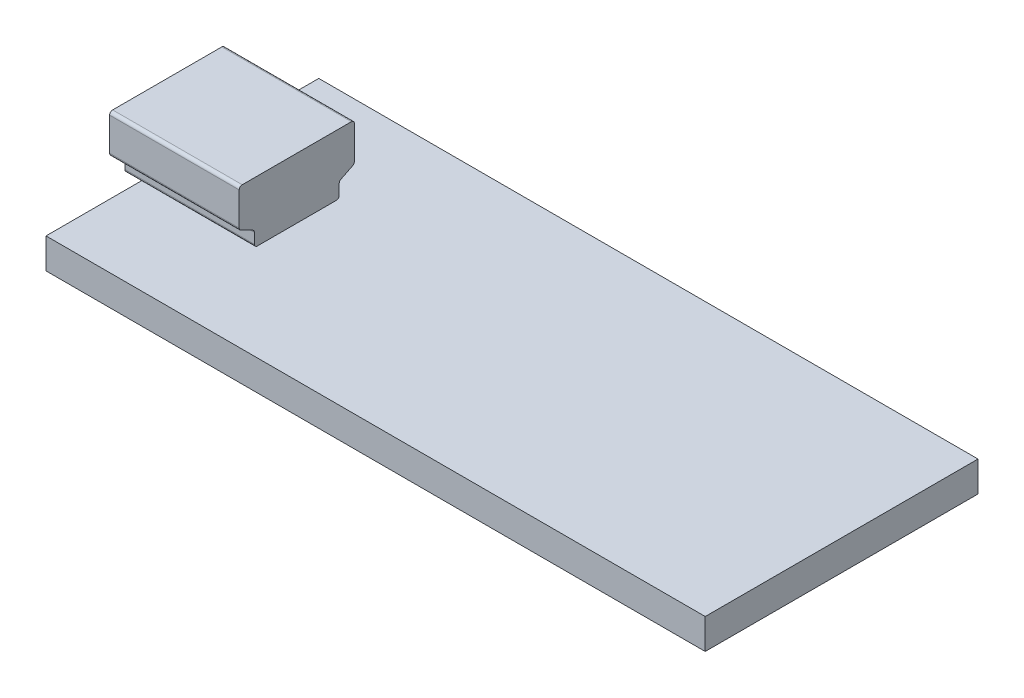
ISO-10303-21;
HEADER;
FILE_DESCRIPTION(('STEP AP214'),'2;1');
FILE_NAME('part.step','',(''),(''),'','','');
FILE_SCHEMA(('AUTOMOTIVE_DESIGN { 1 0 10303 214 1 1 1 1 }'));
ENDSEC;
DATA;
#1=APPLICATION_CONTEXT('core data for automotive mechanical design processes');
#2=APPLICATION_PROTOCOL_DEFINITION('international standard','automotive_design',2000,#1);
#3=PRODUCT_CONTEXT('',#1,'mechanical');
#4=PRODUCT('Part','Part','',(#3));
#5=PRODUCT_RELATED_PRODUCT_CATEGORY('part','',(#4));
#6=PRODUCT_DEFINITION_FORMATION('','',#4);
#7=PRODUCT_DEFINITION_CONTEXT('part definition',#1,'design');
#8=PRODUCT_DEFINITION('design','',#6,#7);
#9=PRODUCT_DEFINITION_SHAPE('','',#8);
#10=(LENGTH_UNIT() NAMED_UNIT(*) SI_UNIT(.MILLI.,.METRE.));
#11=(NAMED_UNIT(*) PLANE_ANGLE_UNIT() SI_UNIT($,.RADIAN.));
#12=(NAMED_UNIT(*) SI_UNIT($,.STERADIAN.) SOLID_ANGLE_UNIT());
#13=UNCERTAINTY_MEASURE_WITH_UNIT(LENGTH_MEASURE(1.E-05),#10,'distance_accuracy_value','');
#14=(GEOMETRIC_REPRESENTATION_CONTEXT(3) GLOBAL_UNCERTAINTY_ASSIGNED_CONTEXT((#13)) GLOBAL_UNIT_ASSIGNED_CONTEXT((#10,
#11,#12)) REPRESENTATION_CONTEXT('',''));
#15=CARTESIAN_POINT('',(0.,0.,0.));
#16=DIRECTION('',(0.,0.,1.));
#17=DIRECTION('',(1.,0.,0.));
#18=AXIS2_PLACEMENT_3D('',#15,#16,#17);
#19=CARTESIAN_POINT('',(-14.2001302464629,6.,-3.8));
#20=DIRECTION('',(-1.,0.,0.));
#21=DIRECTION('',(0.,0.,1.));
#22=AXIS2_PLACEMENT_3D('',#19,#20,#21);
#23=PLANE('',#22);
#24=CARTESIAN_POINT('',(-14.2001302464629,2.2,-2.6));
#25=DIRECTION('',(-1.,0.,0.));
#26=DIRECTION('',(0.,0.,1.));
#27=AXIS2_PLACEMENT_3D('',#24,#25,#26);
#28=CIRCLE('',#27,0.2);
#29=CARTESIAN_POINT('',(-14.2001302464629,2.2,-2.8));
#30=VERTEX_POINT('',#29);
#31=CARTESIAN_POINT('',(-14.2001302464629,2.,-2.6));
#32=VERTEX_POINT('',#31);
#33=EDGE_CURVE('E356',#30,#32,#28,.T.);
#34=ORIENTED_EDGE('',*,*,#33,.F.);
#35=DIRECTION('',(0.,-1.,0.));
#36=VECTOR('',#35,1.);
#37=CARTESIAN_POINT('',(-14.2001302464629,6.,-2.8));
#38=LINE('',#37,#36);
#39=CARTESIAN_POINT('',(-14.2001302464629,2.87639320225002,-2.8));
#40=VERTEX_POINT('',#39);
#41=EDGE_CURVE('E358',#40,#30,#38,.T.);
#42=ORIENTED_EDGE('',*,*,#41,.F.);
#43=CARTESIAN_POINT('',(-14.2001302464629,2.87639320225002,-3.));
#44=DIRECTION('',(-1.,0.,0.));
#45=DIRECTION('',(0.,0.,1.));
#46=AXIS2_PLACEMENT_3D('',#43,#44,#45);
#47=CIRCLE('',#46,0.2);
#48=CARTESIAN_POINT('',(-14.2001302464629,3.05527864045,-2.91055728090001));
#49=VERTEX_POINT('',#48);
#50=EDGE_CURVE('E347',#49,#40,#47,.F.);
#51=ORIENTED_EDGE('',*,*,#50,.F.);
#52=DIRECTION('',(0.,-0.447213595499958,0.894427190999916));
#53=VECTOR('',#52,1.);
#54=CARTESIAN_POINT('',(-14.2001302464629,4.,-4.8));
#55=LINE('',#54,#53);
#56=CARTESIAN_POINT('',(-14.2001302464629,3.44472135955,-3.68944271909999));
#57=VERTEX_POINT('',#56);
#58=EDGE_CURVE('E350',#57,#49,#55,.T.);
#59=ORIENTED_EDGE('',*,*,#58,.F.);
#60=CARTESIAN_POINT('',(-14.2001302464629,3.62360679774998,-3.6));
#61=DIRECTION('',(-1.,0.,0.));
#62=DIRECTION('',(0.,0.,1.));
#63=AXIS2_PLACEMENT_3D('',#60,#61,#62);
#64=CIRCLE('',#63,0.2);
#65=CARTESIAN_POINT('',(-14.2001302464629,3.62360679774998,-3.8));
#66=VERTEX_POINT('',#65);
#67=EDGE_CURVE('E353',#66,#57,#64,.T.);
#68=ORIENTED_EDGE('',*,*,#67,.F.);
#69=DIRECTION('',(0.,-1.,0.));
#70=VECTOR('',#69,1.);
#71=CARTESIAN_POINT('',(-14.2001302464629,6.,-3.8));
#72=LINE('',#71,#70);
#73=CARTESIAN_POINT('',(-14.2001302464629,5.8,-3.8));
#74=VERTEX_POINT('',#73);
#75=EDGE_CURVE('E443',#74,#66,#72,.T.);
#76=ORIENTED_EDGE('',*,*,#75,.F.);
#77=CARTESIAN_POINT('',(-14.2001302464629,5.8,-3.6));
#78=DIRECTION('',(-1.,0.,0.));
#79=DIRECTION('',(0.,0.,1.));
#80=AXIS2_PLACEMENT_3D('',#77,#78,#79);
#81=CIRCLE('',#80,0.2);
#82=CARTESIAN_POINT('',(-14.2001302464629,6.,-3.6));
#83=VERTEX_POINT('',#82);
#84=EDGE_CURVE('E361',#83,#74,#81,.T.);
#85=ORIENTED_EDGE('',*,*,#84,.F.);
#86=DIRECTION('',(0.,0.,-1.));
#87=VECTOR('',#86,1.);
#88=CARTESIAN_POINT('',(-14.2001302464629,6.,-3.8));
#89=LINE('',#88,#87);
#90=CARTESIAN_POINT('',(-14.2001302464629,6.,3.6));
#91=VERTEX_POINT('',#90);
#92=EDGE_CURVE('E441',#91,#83,#89,.T.);
#93=ORIENTED_EDGE('',*,*,#92,.F.);
#94=CARTESIAN_POINT('',(-14.2001302464629,5.8,3.6));
#95=DIRECTION('',(-1.,0.,0.));
#96=DIRECTION('',(0.,0.,1.));
#97=AXIS2_PLACEMENT_3D('',#94,#95,#96);
#98=CIRCLE('',#97,0.2);
#99=CARTESIAN_POINT('',(-14.2001302464629,5.8,3.8));
#100=VERTEX_POINT('',#99);
#101=EDGE_CURVE('E328',#100,#91,#98,.T.);
#102=ORIENTED_EDGE('',*,*,#101,.F.);
#103=DIRECTION('',(0.,-1.,0.));
#104=VECTOR('',#103,1.);
#105=CARTESIAN_POINT('',(-14.2001302464629,6.,3.8));
#106=LINE('',#105,#104);
#107=CARTESIAN_POINT('',(-14.2001302464629,3.62360679774998,3.8));
#108=VERTEX_POINT('',#107);
#109=EDGE_CURVE('E448',#100,#108,#106,.T.);
#110=ORIENTED_EDGE('',*,*,#109,.T.);
#111=CARTESIAN_POINT('',(-14.2001302464629,3.62360679774998,3.6));
#112=DIRECTION('',(-1.,0.,0.));
#113=DIRECTION('',(0.,0.,1.));
#114=AXIS2_PLACEMENT_3D('',#111,#112,#113);
#115=CIRCLE('',#114,0.2);
#116=CARTESIAN_POINT('',(-14.2001302464629,3.44472135955,3.68944271909999));
#117=VERTEX_POINT('',#116);
#118=EDGE_CURVE('E338',#117,#108,#115,.T.);
#119=ORIENTED_EDGE('',*,*,#118,.F.);
#120=DIRECTION('',(0.,0.447213595499958,0.894427190999916));
#121=VECTOR('',#120,1.);
#122=CARTESIAN_POINT('',(-14.2001302464629,0.96,-1.28));
#123=LINE('',#122,#121);
#124=CARTESIAN_POINT('',(-14.2001302464629,3.05527864045001,2.91055728090001));
#125=VERTEX_POINT('',#124);
#126=EDGE_CURVE('E341',#125,#117,#123,.T.);
#127=ORIENTED_EDGE('',*,*,#126,.F.);
#128=CARTESIAN_POINT('',(-14.2001302464629,2.87639320225002,3.));
#129=DIRECTION('',(-1.,0.,0.));
#130=DIRECTION('',(0.,0.,1.));
#131=AXIS2_PLACEMENT_3D('',#128,#129,#130);
#132=CIRCLE('',#131,0.200000000000001);
#133=CARTESIAN_POINT('',(-14.2001302464629,2.87639320225002,2.8));
#134=VERTEX_POINT('',#133);
#135=EDGE_CURVE('E344',#134,#125,#132,.F.);
#136=ORIENTED_EDGE('',*,*,#135,.F.);
#137=DIRECTION('',(0.,1.,0.));
#138=VECTOR('',#137,1.);
#139=CARTESIAN_POINT('',(-14.2001302464629,6.,2.8));
#140=LINE('',#139,#138);
#141=CARTESIAN_POINT('',(-14.2001302464629,2.2,2.8));
#142=VERTEX_POINT('',#141);
#143=EDGE_CURVE('E332',#142,#134,#140,.T.);
#144=ORIENTED_EDGE('',*,*,#143,.F.);
#145=CARTESIAN_POINT('',(-14.2001302464629,2.2,2.6));
#146=DIRECTION('',(-1.,0.,0.));
#147=DIRECTION('',(0.,0.,1.));
#148=AXIS2_PLACEMENT_3D('',#145,#146,#147);
#149=CIRCLE('',#148,0.2);
#150=CARTESIAN_POINT('',(-14.2001302464629,2.,2.6));
#151=VERTEX_POINT('',#150);
#152=EDGE_CURVE('E335',#151,#142,#149,.T.);
#153=ORIENTED_EDGE('',*,*,#152,.F.);
#154=DIRECTION('',(0.,0.,-1.));
#155=VECTOR('',#154,1.);
#156=CARTESIAN_POINT('',(-14.2001302464629,2.,-3.8));
#157=LINE('',#156,#155);
#158=EDGE_CURVE('E440',#151,#32,#157,.T.);
#159=ORIENTED_EDGE('',*,*,#158,.T.);
#160=EDGE_LOOP('',(#34,#42,#51,#59,#68,#76,#85,#93,#102,#110,#119,#127,#136,#144,#153,#159));
#161=FACE_BOUND('',#160,.T.);
#162=ADVANCED_FACE('F35',(#161),#23,.F.);
#163=CARTESIAN_POINT('',(-14.2001302464629,6.,3.8));
#164=DIRECTION('',(0.,0.,-1.));
#165=DIRECTION('',(-1.,0.,0.));
#166=AXIS2_PLACEMENT_3D('',#163,#164,#165);
#167=PLANE('',#166);
#168=DIRECTION('',(1.,0.,0.));
#169=VECTOR('',#168,1.);
#170=CARTESIAN_POINT('',(-22.75,3.62360679774998,3.8));
#171=LINE('',#170,#169);
#172=CARTESIAN_POINT('',(-22.75,3.62360679774998,3.8));
#173=VERTEX_POINT('',#172);
#174=EDGE_CURVE('E408',#173,#108,#171,.T.);
#175=ORIENTED_EDGE('',*,*,#174,.T.);
#176=ORIENTED_EDGE('',*,*,#109,.F.);
#177=DIRECTION('',(1.,0.,0.));
#178=VECTOR('',#177,1.);
#179=CARTESIAN_POINT('',(-22.75,5.8,3.8));
#180=LINE('',#179,#178);
#181=CARTESIAN_POINT('',(-22.75,5.8,3.8));
#182=VERTEX_POINT('',#181);
#183=EDGE_CURVE('E404',#182,#100,#180,.T.);
#184=ORIENTED_EDGE('',*,*,#183,.F.);
#185=DIRECTION('',(0.,1.,0.));
#186=VECTOR('',#185,1.);
#187=CARTESIAN_POINT('',(-22.75,0.,3.8));
#188=LINE('',#187,#186);
#189=EDGE_CURVE('E402',#173,#182,#188,.T.);
#190=ORIENTED_EDGE('',*,*,#189,.F.);
#191=EDGE_LOOP('',(#175,#176,#184,#190));
#192=FACE_BOUND('',#191,.T.);
#193=ADVANCED_FACE('F538',(#192),#167,.F.);
#194=CARTESIAN_POINT('',(0.,6.,0.));
#195=DIRECTION('',(0.,-1.,0.));
#196=DIRECTION('',(0.,0.,-1.));
#197=AXIS2_PLACEMENT_3D('',#194,#195,#196);
#198=PLANE('',#197);
#199=DIRECTION('',(1.,0.,0.));
#200=VECTOR('',#199,1.);
#201=CARTESIAN_POINT('',(-22.75,6.,3.6));
#202=LINE('',#201,#200);
#203=CARTESIAN_POINT('',(-22.75,6.,3.6));
#204=VERTEX_POINT('',#203);
#205=EDGE_CURVE('E58',#204,#91,#202,.T.);
#206=ORIENTED_EDGE('',*,*,#205,.T.);
#207=ORIENTED_EDGE('',*,*,#92,.T.);
#208=DIRECTION('',(1.,0.,0.));
#209=VECTOR('',#208,1.);
#210=CARTESIAN_POINT('',(-22.75,6.,-3.6));
#211=LINE('',#210,#209);
#212=CARTESIAN_POINT('',(-22.75,6.,-3.6));
#213=VERTEX_POINT('',#212);
#214=EDGE_CURVE('E436',#213,#83,#211,.T.);
#215=ORIENTED_EDGE('',*,*,#214,.F.);
#216=DIRECTION('',(0.,0.,-1.));
#217=VECTOR('',#216,1.);
#218=CARTESIAN_POINT('',(-22.75,6.,0.));
#219=LINE('',#218,#217);
#220=EDGE_CURVE('E368',#204,#213,#219,.T.);
#221=ORIENTED_EDGE('',*,*,#220,.F.);
#222=EDGE_LOOP('',(#206,#207,#215,#221));
#223=FACE_BOUND('',#222,.T.);
#224=ADVANCED_FACE('F544',(#223),#198,.F.);
#225=CARTESIAN_POINT('',(-14.2001302464629,6.,-3.8));
#226=DIRECTION('',(0.,0.,1.));
#227=DIRECTION('',(1.,0.,0.));
#228=AXIS2_PLACEMENT_3D('',#225,#226,#227);
#229=PLANE('',#228);
#230=ORIENTED_EDGE('',*,*,#75,.T.);
#231=DIRECTION('',(1.,0.,0.));
#232=VECTOR('',#231,1.);
#233=CARTESIAN_POINT('',(-22.75,3.62360679774998,-3.8));
#234=LINE('',#233,#232);
#235=CARTESIAN_POINT('',(-22.75,3.62360679774998,-3.8));
#236=VERTEX_POINT('',#235);
#237=EDGE_CURVE('E432',#236,#66,#234,.T.);
#238=ORIENTED_EDGE('',*,*,#237,.F.);
#239=DIRECTION('',(0.,-1.,0.));
#240=VECTOR('',#239,1.);
#241=CARTESIAN_POINT('',(-22.75,0.,-3.8));
#242=LINE('',#241,#240);
#243=CARTESIAN_POINT('',(-22.75,5.8,-3.8));
#244=VERTEX_POINT('',#243);
#245=EDGE_CURVE('E373',#244,#236,#242,.T.);
#246=ORIENTED_EDGE('',*,*,#245,.F.);
#247=DIRECTION('',(1.,0.,0.));
#248=VECTOR('',#247,1.);
#249=CARTESIAN_POINT('',(-22.75,5.8,-3.8));
#250=LINE('',#249,#248);
#251=EDGE_CURVE('E434',#244,#74,#250,.T.);
#252=ORIENTED_EDGE('',*,*,#251,.T.);
#253=EDGE_LOOP('',(#230,#238,#246,#252));
#254=FACE_BOUND('',#253,.T.);
#255=ADVANCED_FACE('F554',(#254),#229,.F.);
#256=CARTESIAN_POINT('',(-21.75,2.,-9.));
#257=DIRECTION('',(1.,0.,0.));
#258=DIRECTION('',(0.,0.,-1.));
#259=AXIS2_PLACEMENT_3D('',#256,#257,#258);
#260=PLANE('',#259);
#261=DIRECTION('',(0.,0.,1.));
#262=VECTOR('',#261,1.);
#263=CARTESIAN_POINT('',(-21.75,2.,0.));
#264=LINE('',#263,#262);
#265=CARTESIAN_POINT('',(-21.75,2.,-2.6));
#266=VERTEX_POINT('',#265);
#267=CARTESIAN_POINT('',(-21.75,2.,2.6));
#268=VERTEX_POINT('',#267);
#269=EDGE_CURVE('E364',#266,#268,#264,.T.);
#270=ORIENTED_EDGE('',*,*,#269,.F.);
#271=DIRECTION('',(0.,0.,1.));
#272=VECTOR('',#271,1.);
#273=CARTESIAN_POINT('',(-21.75,2.,-9.));
#274=LINE('',#273,#272);
#275=CARTESIAN_POINT('',(-21.75,2.,-9.));
#276=VERTEX_POINT('',#275);
#277=EDGE_CURVE('E459',#276,#266,#274,.T.);
#278=ORIENTED_EDGE('',*,*,#277,.F.);
#279=DIRECTION('',(0.,-1.,0.));
#280=VECTOR('',#279,1.);
#281=CARTESIAN_POINT('',(-21.75,2.,-9.));
#282=LINE('',#281,#280);
#283=CARTESIAN_POINT('',(-21.75,0.,-9.));
#284=VERTEX_POINT('',#283);
#285=EDGE_CURVE('E43',#276,#284,#282,.T.);
#286=ORIENTED_EDGE('',*,*,#285,.T.);
#287=DIRECTION('',(0.,0.,1.));
#288=VECTOR('',#287,1.);
#289=CARTESIAN_POINT('',(-21.75,0.,-9.));
#290=LINE('',#289,#288);
#291=CARTESIAN_POINT('',(-21.75,0.,9.));
#292=VERTEX_POINT('',#291);
#293=EDGE_CURVE('E468',#284,#292,#290,.T.);
#294=ORIENTED_EDGE('',*,*,#293,.T.);
#295=DIRECTION('',(0.,-1.,0.));
#296=VECTOR('',#295,1.);
#297=CARTESIAN_POINT('',(-21.75,2.,9.));
#298=LINE('',#297,#296);
#299=CARTESIAN_POINT('',(-21.75,2.,9.));
#300=VERTEX_POINT('',#299);
#301=EDGE_CURVE('E473',#300,#292,#298,.T.);
#302=ORIENTED_EDGE('',*,*,#301,.F.);
#303=EDGE_CURVE('E458',#268,#300,#274,.T.);
#304=ORIENTED_EDGE('',*,*,#303,.F.);
#305=EDGE_LOOP('',(#270,#278,#286,#294,#302,#304));
#306=FACE_BOUND('',#305,.T.);
#307=ADVANCED_FACE('F481',(#306),#260,.F.);
#308=CARTESIAN_POINT('',(21.75,2.,-9.));
#309=DIRECTION('',(-1.,0.,0.));
#310=DIRECTION('',(0.,0.,1.));
#311=AXIS2_PLACEMENT_3D('',#308,#309,#310);
#312=PLANE('',#311);
#313=DIRECTION('',(0.,0.,-1.));
#314=VECTOR('',#313,1.);
#315=CARTESIAN_POINT('',(21.75,0.,-9.));
#316=LINE('',#315,#314);
#317=CARTESIAN_POINT('',(21.75,0.,9.));
#318=VERTEX_POINT('',#317);
#319=CARTESIAN_POINT('',(21.75,0.,-9.));
#320=VERTEX_POINT('',#319);
#321=EDGE_CURVE('E451',#318,#320,#316,.T.);
#322=ORIENTED_EDGE('',*,*,#321,.T.);
#323=DIRECTION('',(0.,-1.,0.));
#324=VECTOR('',#323,1.);
#325=CARTESIAN_POINT('',(21.75,2.,-9.));
#326=LINE('',#325,#324);
#327=CARTESIAN_POINT('',(21.75,2.,-9.));
#328=VERTEX_POINT('',#327);
#329=EDGE_CURVE('E11',#328,#320,#326,.T.);
#330=ORIENTED_EDGE('',*,*,#329,.F.);
#331=DIRECTION('',(0.,0.,-1.));
#332=VECTOR('',#331,1.);
#333=CARTESIAN_POINT('',(21.75,2.,-9.));
#334=LINE('',#333,#332);
#335=CARTESIAN_POINT('',(21.75,2.,9.));
#336=VERTEX_POINT('',#335);
#337=EDGE_CURVE('E452',#336,#328,#334,.T.);
#338=ORIENTED_EDGE('',*,*,#337,.F.);
#339=DIRECTION('',(0.,-1.,0.));
#340=VECTOR('',#339,1.);
#341=CARTESIAN_POINT('',(21.75,2.,9.));
#342=LINE('',#341,#340);
#343=EDGE_CURVE('E463',#336,#318,#342,.T.);
#344=ORIENTED_EDGE('',*,*,#343,.T.);
#345=EDGE_LOOP('',(#322,#330,#338,#344));
#346=FACE_BOUND('',#345,.T.);
#347=ADVANCED_FACE('F37',(#346),#312,.F.);
#348=CARTESIAN_POINT('',(-21.75,2.,-9.));
#349=DIRECTION('',(0.,0.,1.));
#350=DIRECTION('',(1.,0.,0.));
#351=AXIS2_PLACEMENT_3D('',#348,#349,#350);
#352=PLANE('',#351);
#353=DIRECTION('',(-1.,0.,0.));
#354=VECTOR('',#353,1.);
#355=CARTESIAN_POINT('',(-21.75,0.,-9.));
#356=LINE('',#355,#354);
#357=EDGE_CURVE('E466',#320,#284,#356,.T.);
#358=ORIENTED_EDGE('',*,*,#357,.T.);
#359=ORIENTED_EDGE('',*,*,#285,.F.);
#360=DIRECTION('',(-1.,0.,0.));
#361=VECTOR('',#360,1.);
#362=CARTESIAN_POINT('',(-21.75,2.,-9.));
#363=LINE('',#362,#361);
#364=EDGE_CURVE('E455',#328,#276,#363,.T.);
#365=ORIENTED_EDGE('',*,*,#364,.F.);
#366=ORIENTED_EDGE('',*,*,#329,.T.);
#367=EDGE_LOOP('',(#358,#359,#365,#366));
#368=FACE_BOUND('',#367,.T.);
#369=ADVANCED_FACE('F595',(#368),#352,.F.);
#370=CARTESIAN_POINT('',(-21.75,2.,9.));
#371=DIRECTION('',(0.,0.,-1.));
#372=DIRECTION('',(-1.,0.,0.));
#373=AXIS2_PLACEMENT_3D('',#370,#371,#372);
#374=PLANE('',#373);
#375=DIRECTION('',(1.,0.,0.));
#376=VECTOR('',#375,1.);
#377=CARTESIAN_POINT('',(-21.75,0.,9.));
#378=LINE('',#377,#376);
#379=EDGE_CURVE('E456',#292,#318,#378,.T.);
#380=ORIENTED_EDGE('',*,*,#379,.T.);
#381=ORIENTED_EDGE('',*,*,#343,.F.);
#382=DIRECTION('',(1.,0.,0.));
#383=VECTOR('',#382,1.);
#384=CARTESIAN_POINT('',(-21.75,2.,9.));
#385=LINE('',#384,#383);
#386=EDGE_CURVE('E461',#300,#336,#385,.T.);
#387=ORIENTED_EDGE('',*,*,#386,.F.);
#388=ORIENTED_EDGE('',*,*,#301,.T.);
#389=EDGE_LOOP('',(#380,#381,#387,#388));
#390=FACE_BOUND('',#389,.T.);
#391=ADVANCED_FACE('F490',(#390),#374,.F.);
#392=CARTESIAN_POINT('',(0.,2.,0.));
#393=DIRECTION('',(0.,1.,0.));
#394=DIRECTION('',(0.,0.,1.));
#395=AXIS2_PLACEMENT_3D('',#392,#393,#394);
#396=PLANE('',#395);
#397=DIRECTION('',(-1.,0.,0.));
#398=VECTOR('',#397,1.);
#399=CARTESIAN_POINT('',(-7.75,2.,-2.6));
#400=LINE('',#399,#398);
#401=EDGE_CURVE('E325',#32,#266,#400,.T.);
#402=ORIENTED_EDGE('',*,*,#401,.F.);
#403=ORIENTED_EDGE('',*,*,#158,.F.);
#404=DIRECTION('',(-1.,0.,0.));
#405=VECTOR('',#404,1.);
#406=CARTESIAN_POINT('',(-7.75,2.,2.6));
#407=LINE('',#406,#405);
#408=EDGE_CURVE('E309',#151,#268,#407,.T.);
#409=ORIENTED_EDGE('',*,*,#408,.T.);
#410=ORIENTED_EDGE('',*,*,#303,.T.);
#411=ORIENTED_EDGE('',*,*,#386,.T.);
#412=ORIENTED_EDGE('',*,*,#337,.T.);
#413=ORIENTED_EDGE('',*,*,#364,.T.);
#414=ORIENTED_EDGE('',*,*,#277,.T.);
#415=EDGE_LOOP('',(#402,#403,#409,#410,#411,#412,#413,#414));
#416=FACE_BOUND('',#415,.T.);
#417=ADVANCED_FACE('F497',(#416),#396,.T.);
#418=CARTESIAN_POINT('',(0.,0.,0.));
#419=DIRECTION('',(0.,1.,0.));
#420=DIRECTION('',(0.,0.,1.));
#421=AXIS2_PLACEMENT_3D('',#418,#419,#420);
#422=PLANE('',#421);
#423=ORIENTED_EDGE('',*,*,#321,.F.);
#424=ORIENTED_EDGE('',*,*,#379,.F.);
#425=ORIENTED_EDGE('',*,*,#293,.F.);
#426=ORIENTED_EDGE('',*,*,#357,.F.);
#427=EDGE_LOOP('',(#423,#424,#425,#426));
#428=FACE_BOUND('',#427,.T.);
#429=ADVANCED_FACE('F487',(#428),#422,.F.);
#430=CARTESIAN_POINT('',(-22.75,5.8,3.6));
#431=DIRECTION('',(1.,0.,0.));
#432=DIRECTION('',(0.,0.,-1.));
#433=AXIS2_PLACEMENT_3D('',#430,#431,#432);
#434=CYLINDRICAL_SURFACE('',#433,0.2);
#435=ORIENTED_EDGE('',*,*,#183,.T.);
#436=ORIENTED_EDGE('',*,*,#101,.T.);
#437=ORIENTED_EDGE('',*,*,#205,.F.);
#438=CARTESIAN_POINT('',(-22.75,5.8,3.6));
#439=DIRECTION('',(-1.,0.,0.));
#440=DIRECTION('',(0.,0.,1.));
#441=AXIS2_PLACEMENT_3D('',#438,#439,#440);
#442=CIRCLE('',#441,0.2);
#443=EDGE_CURVE('E365',#204,#182,#442,.F.);
#444=ORIENTED_EDGE('',*,*,#443,.T.);
#445=EDGE_LOOP('',(#435,#436,#437,#444));
#446=FACE_BOUND('',#445,.T.);
#447=ADVANCED_FACE('F541',(#446),#434,.T.);
#448=CARTESIAN_POINT('',(-22.75,5.8,-3.6));
#449=DIRECTION('',(1.,0.,0.));
#450=DIRECTION('',(0.,0.,-1.));
#451=AXIS2_PLACEMENT_3D('',#448,#449,#450);
#452=CYLINDRICAL_SURFACE('',#451,0.2);
#453=ORIENTED_EDGE('',*,*,#214,.T.);
#454=ORIENTED_EDGE('',*,*,#84,.T.);
#455=ORIENTED_EDGE('',*,*,#251,.F.);
#456=CARTESIAN_POINT('',(-22.75,5.8,-3.6));
#457=DIRECTION('',(-1.,0.,0.));
#458=DIRECTION('',(0.,0.,1.));
#459=AXIS2_PLACEMENT_3D('',#456,#457,#458);
#460=CIRCLE('',#459,0.2);
#461=EDGE_CURVE('E370',#244,#213,#460,.F.);
#462=ORIENTED_EDGE('',*,*,#461,.T.);
#463=EDGE_LOOP('',(#453,#454,#455,#462));
#464=FACE_BOUND('',#463,.T.);
#465=ADVANCED_FACE('F550',(#464),#452,.T.);
#466=CARTESIAN_POINT('',(-22.75,3.62360679774998,-3.6));
#467=DIRECTION('',(1.,0.,0.));
#468=DIRECTION('',(0.,0.,-1.));
#469=AXIS2_PLACEMENT_3D('',#466,#467,#468);
#470=CYLINDRICAL_SURFACE('',#469,0.2);
#471=ORIENTED_EDGE('',*,*,#237,.T.);
#472=ORIENTED_EDGE('',*,*,#67,.T.);
#473=DIRECTION('',(1.,0.,0.));
#474=VECTOR('',#473,1.);
#475=CARTESIAN_POINT('',(-22.75,3.44472135955,-3.68944271909999));
#476=LINE('',#475,#474);
#477=CARTESIAN_POINT('',(-22.75,3.44472135955,-3.68944271909999));
#478=VERTEX_POINT('',#477);
#479=EDGE_CURVE('E430',#478,#57,#476,.T.);
#480=ORIENTED_EDGE('',*,*,#479,.F.);
#481=CARTESIAN_POINT('',(-22.75,3.62360679774998,-3.6));
#482=DIRECTION('',(-1.,0.,0.));
#483=DIRECTION('',(0.,0.,1.));
#484=AXIS2_PLACEMENT_3D('',#481,#482,#483);
#485=CIRCLE('',#484,0.2);
#486=EDGE_CURVE('E375',#478,#236,#485,.F.);
#487=ORIENTED_EDGE('',*,*,#486,.T.);
#488=EDGE_LOOP('',(#471,#472,#480,#487));
#489=FACE_BOUND('',#488,.T.);
#490=ADVANCED_FACE('F557',(#489),#470,.T.);
#491=CARTESIAN_POINT('',(-22.75,1.28,0.64));
#492=DIRECTION('',(0.,0.894427190999916,0.447213595499958));
#493=DIRECTION('',(0.,-0.447213595499958,0.894427190999916));
#494=AXIS2_PLACEMENT_3D('',#491,#492,#493);
#495=PLANE('',#494);
#496=ORIENTED_EDGE('',*,*,#479,.T.);
#497=ORIENTED_EDGE('',*,*,#58,.T.);
#498=DIRECTION('',(1.,0.,0.));
#499=VECTOR('',#498,1.);
#500=CARTESIAN_POINT('',(-22.75,3.05527864045001,-2.91055728090001));
#501=LINE('',#500,#499);
#502=CARTESIAN_POINT('',(-22.75,3.05527864045001,-2.91055728090001));
#503=VERTEX_POINT('',#502);
#504=EDGE_CURVE('E428',#503,#49,#501,.T.);
#505=ORIENTED_EDGE('',*,*,#504,.F.);
#506=DIRECTION('',(0.,-0.447213595499958,0.894427190999916));
#507=VECTOR('',#506,1.);
#508=CARTESIAN_POINT('',(-22.75,1.28,0.64));
#509=LINE('',#508,#507);
#510=EDGE_CURVE('E378',#478,#503,#509,.T.);
#511=ORIENTED_EDGE('',*,*,#510,.F.);
#512=EDGE_LOOP('',(#496,#497,#505,#511));
#513=FACE_BOUND('',#512,.T.);
#514=ADVANCED_FACE('F563',(#513),#495,.F.);
#515=CARTESIAN_POINT('',(-22.75,2.87639320225002,-3.));
#516=DIRECTION('',(1.,0.,0.));
#517=DIRECTION('',(0.,0.,-1.));
#518=AXIS2_PLACEMENT_3D('',#515,#516,#517);
#519=CYLINDRICAL_SURFACE('',#518,0.2);
#520=ORIENTED_EDGE('',*,*,#504,.T.);
#521=ORIENTED_EDGE('',*,*,#50,.T.);
#522=DIRECTION('',(1.,0.,0.));
#523=VECTOR('',#522,1.);
#524=CARTESIAN_POINT('',(-22.75,2.87639320225002,-2.8));
#525=LINE('',#524,#523);
#526=CARTESIAN_POINT('',(-22.75,2.87639320225002,-2.8));
#527=VERTEX_POINT('',#526);
#528=EDGE_CURVE('E426',#527,#40,#525,.T.);
#529=ORIENTED_EDGE('',*,*,#528,.F.);
#530=CARTESIAN_POINT('',(-22.75,2.87639320225002,-3.));
#531=DIRECTION('',(-1.,0.,0.));
#532=DIRECTION('',(0.,0.,1.));
#533=AXIS2_PLACEMENT_3D('',#530,#531,#532);
#534=CIRCLE('',#533,0.2);
#535=EDGE_CURVE('E380',#503,#527,#534,.F.);
#536=ORIENTED_EDGE('',*,*,#535,.F.);
#537=EDGE_LOOP('',(#520,#521,#529,#536));
#538=FACE_BOUND('',#537,.T.);
#539=ADVANCED_FACE('F567',(#538),#519,.F.);
#540=CARTESIAN_POINT('',(-22.75,0.,-2.8));
#541=DIRECTION('',(0.,0.,1.));
#542=DIRECTION('',(1.,0.,0.));
#543=AXIS2_PLACEMENT_3D('',#540,#541,#542);
#544=PLANE('',#543);
#545=ORIENTED_EDGE('',*,*,#528,.T.);
#546=ORIENTED_EDGE('',*,*,#41,.T.);
#547=DIRECTION('',(1.,0.,0.));
#548=VECTOR('',#547,1.);
#549=CARTESIAN_POINT('',(-22.75,2.2,-2.8));
#550=LINE('',#549,#548);
#551=CARTESIAN_POINT('',(-22.75,2.2,-2.8));
#552=VERTEX_POINT('',#551);
#553=EDGE_CURVE('E424',#552,#30,#550,.T.);
#554=ORIENTED_EDGE('',*,*,#553,.F.);
#555=DIRECTION('',(0.,-1.,0.));
#556=VECTOR('',#555,1.);
#557=CARTESIAN_POINT('',(-22.75,0.,-2.8));
#558=LINE('',#557,#556);
#559=EDGE_CURVE('E382',#527,#552,#558,.T.);
#560=ORIENTED_EDGE('',*,*,#559,.F.);
#561=EDGE_LOOP('',(#545,#546,#554,#560));
#562=FACE_BOUND('',#561,.T.);
#563=ADVANCED_FACE('F571',(#562),#544,.F.);
#564=CARTESIAN_POINT('',(-22.75,2.2,-2.6));
#565=DIRECTION('',(1.,0.,0.));
#566=DIRECTION('',(0.,0.,-1.));
#567=AXIS2_PLACEMENT_3D('',#564,#565,#566);
#568=CYLINDRICAL_SURFACE('',#567,0.2);
#569=ORIENTED_EDGE('',*,*,#553,.T.);
#570=ORIENTED_EDGE('',*,*,#33,.T.);
#571=ORIENTED_EDGE('',*,*,#401,.T.);
#572=DIRECTION('',(1.,0.,0.));
#573=VECTOR('',#572,1.);
#574=CARTESIAN_POINT('',(-22.75,2.,-2.6));
#575=LINE('',#574,#573);
#576=CARTESIAN_POINT('',(-22.75,2.,-2.6));
#577=VERTEX_POINT('',#576);
#578=EDGE_CURVE('E421',#577,#266,#575,.T.);
#579=ORIENTED_EDGE('',*,*,#578,.F.);
#580=CARTESIAN_POINT('',(-22.75,2.2,-2.6));
#581=DIRECTION('',(-1.,0.,0.));
#582=DIRECTION('',(0.,0.,1.));
#583=AXIS2_PLACEMENT_3D('',#580,#581,#582);
#584=CIRCLE('',#583,0.2);
#585=EDGE_CURVE('E384',#552,#577,#584,.T.);
#586=ORIENTED_EDGE('',*,*,#585,.F.);
#587=EDGE_LOOP('',(#569,#570,#571,#579,#586));
#588=FACE_BOUND('',#587,.T.);
#589=ADVANCED_FACE('F506',(#588),#568,.T.);
#590=CARTESIAN_POINT('',(-22.75,2.,0.));
#591=DIRECTION('',(0.,1.,0.));
#592=DIRECTION('',(0.,0.,1.));
#593=AXIS2_PLACEMENT_3D('',#590,#591,#592);
#594=PLANE('',#593);
#595=ORIENTED_EDGE('',*,*,#269,.T.);
#596=DIRECTION('',(1.,0.,0.));
#597=VECTOR('',#596,1.);
#598=CARTESIAN_POINT('',(-22.75,2.,2.6));
#599=LINE('',#598,#597);
#600=CARTESIAN_POINT('',(-22.75,2.,2.6));
#601=VERTEX_POINT('',#600);
#602=EDGE_CURVE('E418',#601,#268,#599,.T.);
#603=ORIENTED_EDGE('',*,*,#602,.F.);
#604=DIRECTION('',(0.,0.,1.));
#605=VECTOR('',#604,1.);
#606=CARTESIAN_POINT('',(-22.75,2.,0.));
#607=LINE('',#606,#605);
#608=EDGE_CURVE('E386',#577,#601,#607,.T.);
#609=ORIENTED_EDGE('',*,*,#608,.F.);
#610=ORIENTED_EDGE('',*,*,#578,.T.);
#611=EDGE_LOOP('',(#595,#603,#609,#610));
#612=FACE_BOUND('',#611,.T.);
#613=ADVANCED_FACE('F501',(#612),#594,.F.);
#614=CARTESIAN_POINT('',(-22.75,2.2,2.6));
#615=DIRECTION('',(1.,0.,0.));
#616=DIRECTION('',(0.,0.,-1.));
#617=AXIS2_PLACEMENT_3D('',#614,#615,#616);
#618=CYLINDRICAL_SURFACE('',#617,0.2);
#619=ORIENTED_EDGE('',*,*,#602,.T.);
#620=ORIENTED_EDGE('',*,*,#408,.F.);
#621=ORIENTED_EDGE('',*,*,#152,.T.);
#622=DIRECTION('',(1.,0.,0.));
#623=VECTOR('',#622,1.);
#624=CARTESIAN_POINT('',(-22.75,2.2,2.8));
#625=LINE('',#624,#623);
#626=CARTESIAN_POINT('',(-22.75,2.2,2.8));
#627=VERTEX_POINT('',#626);
#628=EDGE_CURVE('E416',#627,#142,#625,.T.);
#629=ORIENTED_EDGE('',*,*,#628,.F.);
#630=CARTESIAN_POINT('',(-22.75,2.2,2.6));
#631=DIRECTION('',(-1.,0.,0.));
#632=DIRECTION('',(0.,0.,1.));
#633=AXIS2_PLACEMENT_3D('',#630,#631,#632);
#634=CIRCLE('',#633,0.2);
#635=EDGE_CURVE('E388',#627,#601,#634,.F.);
#636=ORIENTED_EDGE('',*,*,#635,.T.);
#637=EDGE_LOOP('',(#619,#620,#621,#629,#636));
#638=FACE_BOUND('',#637,.T.);
#639=ADVANCED_FACE('F514',(#638),#618,.T.);
#640=CARTESIAN_POINT('',(-22.75,0.,2.8));
#641=DIRECTION('',(0.,0.,1.));
#642=DIRECTION('',(1.,0.,0.));
#643=AXIS2_PLACEMENT_3D('',#640,#641,#642);
#644=PLANE('',#643);
#645=ORIENTED_EDGE('',*,*,#628,.T.);
#646=ORIENTED_EDGE('',*,*,#143,.T.);
#647=DIRECTION('',(1.,0.,0.));
#648=VECTOR('',#647,1.);
#649=CARTESIAN_POINT('',(-22.75,2.87639320225002,2.8));
#650=LINE('',#649,#648);
#651=CARTESIAN_POINT('',(-22.75,2.87639320225002,2.8));
#652=VERTEX_POINT('',#651);
#653=EDGE_CURVE('E414',#652,#134,#650,.T.);
#654=ORIENTED_EDGE('',*,*,#653,.F.);
#655=DIRECTION('',(0.,-1.,0.));
#656=VECTOR('',#655,1.);
#657=CARTESIAN_POINT('',(-22.75,0.,2.8));
#658=LINE('',#657,#656);
#659=EDGE_CURVE('E391',#652,#627,#658,.T.);
#660=ORIENTED_EDGE('',*,*,#659,.T.);
#661=EDGE_LOOP('',(#645,#646,#654,#660));
#662=FACE_BOUND('',#661,.T.);
#663=ADVANCED_FACE('F522',(#662),#644,.T.);
#664=CARTESIAN_POINT('',(-22.75,2.87639320225002,3.));
#665=DIRECTION('',(1.,0.,0.));
#666=DIRECTION('',(0.,0.,-1.));
#667=AXIS2_PLACEMENT_3D('',#664,#665,#666);
#668=CYLINDRICAL_SURFACE('',#667,0.2);
#669=ORIENTED_EDGE('',*,*,#653,.T.);
#670=ORIENTED_EDGE('',*,*,#135,.T.);
#671=DIRECTION('',(1.,0.,0.));
#672=VECTOR('',#671,1.);
#673=CARTESIAN_POINT('',(-22.75,3.05527864045001,2.91055728090001));
#674=LINE('',#673,#672);
#675=CARTESIAN_POINT('',(-22.75,3.05527864045001,2.91055728090001));
#676=VERTEX_POINT('',#675);
#677=EDGE_CURVE('E412',#676,#125,#674,.T.);
#678=ORIENTED_EDGE('',*,*,#677,.F.);
#679=CARTESIAN_POINT('',(-22.75,2.87639320225002,3.));
#680=DIRECTION('',(-1.,0.,0.));
#681=DIRECTION('',(0.,0.,1.));
#682=AXIS2_PLACEMENT_3D('',#679,#680,#681);
#683=CIRCLE('',#682,0.2);
#684=EDGE_CURVE('E394',#676,#652,#683,.T.);
#685=ORIENTED_EDGE('',*,*,#684,.T.);
#686=EDGE_LOOP('',(#669,#670,#678,#685));
#687=FACE_BOUND('',#686,.T.);
#688=ADVANCED_FACE('F524',(#687),#668,.F.);
#689=CARTESIAN_POINT('',(-22.75,1.28,-0.64));
#690=DIRECTION('',(0.,-0.894427190999916,0.447213595499958));
#691=DIRECTION('',(0.,-0.447213595499958,-0.894427190999916));
#692=AXIS2_PLACEMENT_3D('',#689,#690,#691);
#693=PLANE('',#692);
#694=ORIENTED_EDGE('',*,*,#677,.T.);
#695=ORIENTED_EDGE('',*,*,#126,.T.);
#696=DIRECTION('',(1.,0.,0.));
#697=VECTOR('',#696,1.);
#698=CARTESIAN_POINT('',(-22.75,3.44472135955,3.68944271909999));
#699=LINE('',#698,#697);
#700=CARTESIAN_POINT('',(-22.75,3.44472135955,3.68944271909999));
#701=VERTEX_POINT('',#700);
#702=EDGE_CURVE('E410',#701,#117,#699,.T.);
#703=ORIENTED_EDGE('',*,*,#702,.F.);
#704=DIRECTION('',(0.,-0.447213595499958,-0.894427190999916));
#705=VECTOR('',#704,1.);
#706=CARTESIAN_POINT('',(-22.75,1.28,-0.64));
#707=LINE('',#706,#705);
#708=EDGE_CURVE('E397',#701,#676,#707,.T.);
#709=ORIENTED_EDGE('',*,*,#708,.T.);
#710=EDGE_LOOP('',(#694,#695,#703,#709));
#711=FACE_BOUND('',#710,.T.);
#712=ADVANCED_FACE('F528',(#711),#693,.T.);
#713=CARTESIAN_POINT('',(-22.75,3.62360679774998,3.6));
#714=DIRECTION('',(1.,0.,0.));
#715=DIRECTION('',(0.,0.,-1.));
#716=AXIS2_PLACEMENT_3D('',#713,#714,#715);
#717=CYLINDRICAL_SURFACE('',#716,0.2);
#718=ORIENTED_EDGE('',*,*,#702,.T.);
#719=ORIENTED_EDGE('',*,*,#118,.T.);
#720=ORIENTED_EDGE('',*,*,#174,.F.);
#721=CARTESIAN_POINT('',(-22.75,3.62360679774998,3.6));
#722=DIRECTION('',(-1.,0.,0.));
#723=DIRECTION('',(0.,0.,1.));
#724=AXIS2_PLACEMENT_3D('',#721,#722,#723);
#725=CIRCLE('',#724,0.2);
#726=EDGE_CURVE('E400',#701,#173,#725,.T.);
#727=ORIENTED_EDGE('',*,*,#726,.F.);
#728=EDGE_LOOP('',(#718,#719,#720,#727));
#729=FACE_BOUND('',#728,.T.);
#730=ADVANCED_FACE('F533',(#729),#717,.T.);
#731=CARTESIAN_POINT('',(-22.75,0.,0.));
#732=DIRECTION('',(-1.,0.,0.));
#733=DIRECTION('',(0.,0.,1.));
#734=AXIS2_PLACEMENT_3D('',#731,#732,#733);
#735=PLANE('',#734);
#736=DIRECTION('',(0.,1.,0.));
#737=VECTOR('',#736,1.);
#738=CARTESIAN_POINT('',(-22.75,3.93262379212493,3.1));
#739=LINE('',#738,#737);
#740=CARTESIAN_POINT('',(-22.75,3.93262379212493,3.1));
#741=VERTEX_POINT('',#740);
#742=CARTESIAN_POINT('',(-22.75,5.3,3.1));
#743=VERTEX_POINT('',#742);
#744=EDGE_CURVE('E50',#741,#743,#739,.T.);
#745=ORIENTED_EDGE('',*,*,#744,.F.);
#746=DIRECTION('',(0.,0.447213595499958,0.894427190999916));
#747=VECTOR('',#746,1.);
#748=CARTESIAN_POINT('',(-22.75,3.68137767414995,2.59750776405004));
#749=LINE('',#748,#747);
#750=CARTESIAN_POINT('',(-22.75,3.68137767414995,2.59750776405004));
#751=VERTEX_POINT('',#750);
#752=EDGE_CURVE('E259',#751,#741,#749,.T.);
#753=ORIENTED_EDGE('',*,*,#752,.F.);
#754=CARTESIAN_POINT('',(-22.75,2.87639320225002,3.));
#755=DIRECTION('',(1.,0.,0.));
#756=DIRECTION('',(0.,0.,1.));
#757=AXIS2_PLACEMENT_3D('',#754,#755,#756);
#758=CIRCLE('',#757,0.9);
#759=CARTESIAN_POINT('',(-22.75,2.87639320225002,2.1));
#760=VERTEX_POINT('',#759);
#761=EDGE_CURVE('E262',#760,#751,#758,.T.);
#762=ORIENTED_EDGE('',*,*,#761,.F.);
#763=DIRECTION('',(0.,1.,0.));
#764=VECTOR('',#763,1.);
#765=CARTESIAN_POINT('',(-22.75,2.7,2.1));
#766=LINE('',#765,#764);
#767=CARTESIAN_POINT('',(-22.75,2.7,2.1));
#768=VERTEX_POINT('',#767);
#769=EDGE_CURVE('E302',#768,#760,#766,.T.);
#770=ORIENTED_EDGE('',*,*,#769,.F.);
#771=DIRECTION('',(0.,0.,1.));
#772=VECTOR('',#771,1.);
#773=CARTESIAN_POINT('',(-22.75,2.7,-2.1));
#774=LINE('',#773,#772);
#775=CARTESIAN_POINT('',(-22.75,2.7,-2.1));
#776=VERTEX_POINT('',#775);
#777=EDGE_CURVE('E299',#776,#768,#774,.T.);
#778=ORIENTED_EDGE('',*,*,#777,.F.);
#779=DIRECTION('',(0.,-1.,0.));
#780=VECTOR('',#779,1.);
#781=CARTESIAN_POINT('',(-22.75,2.87639320225002,-2.1));
#782=LINE('',#781,#780);
#783=CARTESIAN_POINT('',(-22.75,2.87639320225002,-2.1));
#784=VERTEX_POINT('',#783);
#785=EDGE_CURVE('E296',#784,#776,#782,.T.);
#786=ORIENTED_EDGE('',*,*,#785,.F.);
#787=CARTESIAN_POINT('',(-22.75,2.87639320225002,-3.));
#788=DIRECTION('',(1.,0.,0.));
#789=DIRECTION('',(0.,0.,1.));
#790=AXIS2_PLACEMENT_3D('',#787,#788,#789);
#791=CIRCLE('',#790,0.900000000000001);
#792=CARTESIAN_POINT('',(-22.75,3.68137767414995,-2.59750776405004));
#793=VERTEX_POINT('',#792);
#794=EDGE_CURVE('E293',#793,#784,#791,.T.);
#795=ORIENTED_EDGE('',*,*,#794,.F.);
#796=DIRECTION('',(0.,-0.447213595499958,0.894427190999916));
#797=VECTOR('',#796,1.);
#798=CARTESIAN_POINT('',(-22.75,3.93262379212493,-3.1));
#799=LINE('',#798,#797);
#800=CARTESIAN_POINT('',(-22.75,3.93262379212493,-3.1));
#801=VERTEX_POINT('',#800);
#802=EDGE_CURVE('E290',#801,#793,#799,.T.);
#803=ORIENTED_EDGE('',*,*,#802,.F.);
#804=DIRECTION('',(0.,-1.,0.));
#805=VECTOR('',#804,1.);
#806=CARTESIAN_POINT('',(-22.75,5.3,-3.1));
#807=LINE('',#806,#805);
#808=CARTESIAN_POINT('',(-22.75,5.3,-3.1));
#809=VERTEX_POINT('',#808);
#810=EDGE_CURVE('E287',#809,#801,#807,.T.);
#811=ORIENTED_EDGE('',*,*,#810,.F.);
#812=DIRECTION('',(0.,0.,-1.));
#813=VECTOR('',#812,1.);
#814=CARTESIAN_POINT('',(-22.75,5.3,3.1));
#815=LINE('',#814,#813);
#816=EDGE_CURVE('E285',#743,#809,#815,.T.);
#817=ORIENTED_EDGE('',*,*,#816,.F.);
#818=EDGE_LOOP('',(#745,#753,#762,#770,#778,#786,#795,#803,#811,#817));
#819=FACE_BOUND('',#818,.T.);
#820=ORIENTED_EDGE('',*,*,#443,.F.);
#821=ORIENTED_EDGE('',*,*,#220,.T.);
#822=ORIENTED_EDGE('',*,*,#461,.F.);
#823=ORIENTED_EDGE('',*,*,#245,.T.);
#824=ORIENTED_EDGE('',*,*,#486,.F.);
#825=ORIENTED_EDGE('',*,*,#510,.T.);
#826=ORIENTED_EDGE('',*,*,#535,.T.);
#827=ORIENTED_EDGE('',*,*,#559,.T.);
#828=ORIENTED_EDGE('',*,*,#585,.T.);
#829=ORIENTED_EDGE('',*,*,#608,.T.);
#830=ORIENTED_EDGE('',*,*,#635,.F.);
#831=ORIENTED_EDGE('',*,*,#659,.F.);
#832=ORIENTED_EDGE('',*,*,#684,.F.);
#833=ORIENTED_EDGE('',*,*,#708,.F.);
#834=ORIENTED_EDGE('',*,*,#726,.T.);
#835=ORIENTED_EDGE('',*,*,#189,.T.);
#836=EDGE_LOOP('',(#820,#821,#822,#823,#824,#825,#826,#827,#828,#829,#830,#831,#832,#833,#834,#835));
#837=FACE_BOUND('',#836,.T.);
#838=ADVANCED_FACE('F519',(#819,#837),#735,.T.);
#839=CARTESIAN_POINT('',(-14.75,3.93262379212493,3.1));
#840=DIRECTION('',(0.,0.,1.));
#841=DIRECTION('',(1.,0.,0.));
#842=AXIS2_PLACEMENT_3D('',#839,#840,#841);
#843=PLANE('',#842);
#844=ORIENTED_EDGE('',*,*,#744,.T.);
#845=DIRECTION('',(-1.,0.,0.));
#846=VECTOR('',#845,1.);
#847=CARTESIAN_POINT('',(-14.75,5.3,3.1));
#848=LINE('',#847,#846);
#849=CARTESIAN_POINT('',(-14.75,5.3,3.1));
#850=VERTEX_POINT('',#849);
#851=EDGE_CURVE('E236',#850,#743,#848,.T.);
#852=ORIENTED_EDGE('',*,*,#851,.F.);
#853=DIRECTION('',(0.,1.,0.));
#854=VECTOR('',#853,1.);
#855=CARTESIAN_POINT('',(-14.75,3.93262379212493,3.1));
#856=LINE('',#855,#854);
#857=CARTESIAN_POINT('',(-14.75,3.93262379212493,3.1));
#858=VERTEX_POINT('',#857);
#859=EDGE_CURVE('E240',#858,#850,#856,.T.);
#860=ORIENTED_EDGE('',*,*,#859,.F.);
#861=DIRECTION('',(-1.,0.,0.));
#862=VECTOR('',#861,1.);
#863=CARTESIAN_POINT('',(-14.75,3.93262379212493,3.1));
#864=LINE('',#863,#862);
#865=EDGE_CURVE('E307',#858,#741,#864,.T.);
#866=ORIENTED_EDGE('',*,*,#865,.T.);
#867=EDGE_LOOP('',(#844,#852,#860,#866));
#868=FACE_BOUND('',#867,.T.);
#869=ADVANCED_FACE('F238',(#868),#843,.F.);
#870=CARTESIAN_POINT('',(-14.75,3.68137767414995,2.59750776405004));
#871=DIRECTION('',(0.,-0.894427190999916,0.447213595499958));
#872=DIRECTION('',(0.,-0.447213595499958,-0.894427190999916));
#873=AXIS2_PLACEMENT_3D('',#870,#871,#872);
#874=PLANE('',#873);
#875=ORIENTED_EDGE('',*,*,#752,.T.);
#876=ORIENTED_EDGE('',*,*,#865,.F.);
#877=DIRECTION('',(0.,0.447213595499958,0.894427190999916));
#878=VECTOR('',#877,1.);
#879=CARTESIAN_POINT('',(-14.75,3.68137767414995,2.59750776405004));
#880=LINE('',#879,#878);
#881=CARTESIAN_POINT('',(-14.75,3.68137767414995,2.59750776405004));
#882=VERTEX_POINT('',#881);
#883=EDGE_CURVE('E246',#882,#858,#880,.T.);
#884=ORIENTED_EDGE('',*,*,#883,.F.);
#885=DIRECTION('',(-1.,0.,0.));
#886=VECTOR('',#885,1.);
#887=CARTESIAN_POINT('',(-14.75,3.68137767414995,2.59750776405004));
#888=LINE('',#887,#886);
#889=EDGE_CURVE('E310',#882,#751,#888,.T.);
#890=ORIENTED_EDGE('',*,*,#889,.T.);
#891=EDGE_LOOP('',(#875,#876,#884,#890));
#892=FACE_BOUND('',#891,.T.);
#893=ADVANCED_FACE('F783',(#892),#874,.F.);
#894=CARTESIAN_POINT('',(-14.75,2.87639320225002,3.));
#895=DIRECTION('',(-1.,0.,0.));
#896=DIRECTION('',(0.,0.,1.));
#897=AXIS2_PLACEMENT_3D('',#894,#895,#896);
#898=CYLINDRICAL_SURFACE('',#897,0.9);
#899=ORIENTED_EDGE('',*,*,#761,.T.);
#900=ORIENTED_EDGE('',*,*,#889,.F.);
#901=CARTESIAN_POINT('',(-14.75,2.87639320225002,3.));
#902=DIRECTION('',(1.,0.,0.));
#903=DIRECTION('',(0.,0.,1.));
#904=AXIS2_PLACEMENT_3D('',#901,#902,#903);
#905=CIRCLE('',#904,0.9);
#906=CARTESIAN_POINT('',(-14.75,2.87639320225002,2.1));
#907=VERTEX_POINT('',#906);
#908=EDGE_CURVE('E281',#907,#882,#905,.T.);
#909=ORIENTED_EDGE('',*,*,#908,.F.);
#910=DIRECTION('',(-1.,0.,0.));
#911=VECTOR('',#910,1.);
#912=CARTESIAN_POINT('',(-14.75,2.87639320225002,2.1));
#913=LINE('',#912,#911);
#914=EDGE_CURVE('E312',#907,#760,#913,.T.);
#915=ORIENTED_EDGE('',*,*,#914,.T.);
#916=EDGE_LOOP('',(#899,#900,#909,#915));
#917=FACE_BOUND('',#916,.T.);
#918=ADVANCED_FACE('F792',(#917),#898,.T.);
#919=CARTESIAN_POINT('',(-14.75,2.7,2.1));
#920=DIRECTION('',(0.,0.,1.));
#921=DIRECTION('',(1.,0.,0.));
#922=AXIS2_PLACEMENT_3D('',#919,#920,#921);
#923=PLANE('',#922);
#924=ORIENTED_EDGE('',*,*,#769,.T.);
#925=ORIENTED_EDGE('',*,*,#914,.F.);
#926=DIRECTION('',(0.,1.,0.));
#927=VECTOR('',#926,1.);
#928=CARTESIAN_POINT('',(-14.75,2.7,2.1));
#929=LINE('',#928,#927);
#930=CARTESIAN_POINT('',(-14.75,2.7,2.1));
#931=VERTEX_POINT('',#930);
#932=EDGE_CURVE('E278',#931,#907,#929,.T.);
#933=ORIENTED_EDGE('',*,*,#932,.F.);
#934=DIRECTION('',(-1.,0.,0.));
#935=VECTOR('',#934,1.);
#936=CARTESIAN_POINT('',(-14.75,2.7,2.1));
#937=LINE('',#936,#935);
#938=EDGE_CURVE('E314',#931,#768,#937,.T.);
#939=ORIENTED_EDGE('',*,*,#938,.T.);
#940=EDGE_LOOP('',(#924,#925,#933,#939));
#941=FACE_BOUND('',#940,.T.);
#942=ADVANCED_FACE('F802',(#941),#923,.F.);
#943=CARTESIAN_POINT('',(-14.75,2.7,-2.1));
#944=DIRECTION('',(0.,-1.,0.));
#945=DIRECTION('',(0.,0.,-1.));
#946=AXIS2_PLACEMENT_3D('',#943,#944,#945);
#947=PLANE('',#946);
#948=ORIENTED_EDGE('',*,*,#777,.T.);
#949=ORIENTED_EDGE('',*,*,#938,.F.);
#950=DIRECTION('',(0.,0.,1.));
#951=VECTOR('',#950,1.);
#952=CARTESIAN_POINT('',(-14.75,2.7,-2.1));
#953=LINE('',#952,#951);
#954=CARTESIAN_POINT('',(-14.75,2.7,-2.1));
#955=VERTEX_POINT('',#954);
#956=EDGE_CURVE('E275',#955,#931,#953,.T.);
#957=ORIENTED_EDGE('',*,*,#956,.F.);
#958=DIRECTION('',(-1.,0.,0.));
#959=VECTOR('',#958,1.);
#960=CARTESIAN_POINT('',(-14.75,2.7,-2.1));
#961=LINE('',#960,#959);
#962=EDGE_CURVE('E316',#955,#776,#961,.T.);
#963=ORIENTED_EDGE('',*,*,#962,.T.);
#964=EDGE_LOOP('',(#948,#949,#957,#963));
#965=FACE_BOUND('',#964,.T.);
#966=ADVANCED_FACE('F812',(#965),#947,.F.);
#967=CARTESIAN_POINT('',(-14.75,2.87639320225002,-2.1));
#968=DIRECTION('',(0.,0.,-1.));
#969=DIRECTION('',(-1.,0.,0.));
#970=AXIS2_PLACEMENT_3D('',#967,#968,#969);
#971=PLANE('',#970);
#972=ORIENTED_EDGE('',*,*,#785,.T.);
#973=ORIENTED_EDGE('',*,*,#962,.F.);
#974=DIRECTION('',(0.,-1.,0.));
#975=VECTOR('',#974,1.);
#976=CARTESIAN_POINT('',(-14.75,2.87639320225002,-2.1));
#977=LINE('',#976,#975);
#978=CARTESIAN_POINT('',(-14.75,2.87639320225002,-2.1));
#979=VERTEX_POINT('',#978);
#980=EDGE_CURVE('E272',#979,#955,#977,.T.);
#981=ORIENTED_EDGE('',*,*,#980,.F.);
#982=DIRECTION('',(-1.,0.,0.));
#983=VECTOR('',#982,1.);
#984=CARTESIAN_POINT('',(-14.75,2.87639320225002,-2.1));
#985=LINE('',#984,#983);
#986=EDGE_CURVE('E318',#979,#784,#985,.T.);
#987=ORIENTED_EDGE('',*,*,#986,.T.);
#988=EDGE_LOOP('',(#972,#973,#981,#987));
#989=FACE_BOUND('',#988,.T.);
#990=ADVANCED_FACE('F822',(#989),#971,.F.);
#991=CARTESIAN_POINT('',(-14.75,2.87639320225002,-3.));
#992=DIRECTION('',(-1.,0.,0.));
#993=DIRECTION('',(0.,0.,1.));
#994=AXIS2_PLACEMENT_3D('',#991,#992,#993);
#995=CYLINDRICAL_SURFACE('',#994,0.900000000000001);
#996=ORIENTED_EDGE('',*,*,#794,.T.);
#997=ORIENTED_EDGE('',*,*,#986,.F.);
#998=CARTESIAN_POINT('',(-14.75,2.87639320225002,-3.));
#999=DIRECTION('',(1.,0.,0.));
#1000=DIRECTION('',(0.,0.,1.));
#1001=AXIS2_PLACEMENT_3D('',#998,#999,#1000);
#1002=CIRCLE('',#1001,0.900000000000001);
#1003=CARTESIAN_POINT('',(-14.75,3.68137767414995,-2.59750776405004));
#1004=VERTEX_POINT('',#1003);
#1005=EDGE_CURVE('E269',#1004,#979,#1002,.T.);
#1006=ORIENTED_EDGE('',*,*,#1005,.F.);
#1007=DIRECTION('',(-1.,0.,0.));
#1008=VECTOR('',#1007,1.);
#1009=CARTESIAN_POINT('',(-14.75,3.68137767414995,-2.59750776405004));
#1010=LINE('',#1009,#1008);
#1011=EDGE_CURVE('E320',#1004,#793,#1010,.T.);
#1012=ORIENTED_EDGE('',*,*,#1011,.T.);
#1013=EDGE_LOOP('',(#996,#997,#1006,#1012));
#1014=FACE_BOUND('',#1013,.T.);
#1015=ADVANCED_FACE('F832',(#1014),#995,.T.);
#1016=CARTESIAN_POINT('',(-14.75,3.93262379212493,-3.1));
#1017=DIRECTION('',(0.,-0.894427190999916,-0.447213595499958));
#1018=DIRECTION('',(0.,0.447213595499958,-0.894427190999916));
#1019=AXIS2_PLACEMENT_3D('',#1016,#1017,#1018);
#1020=PLANE('',#1019);
#1021=ORIENTED_EDGE('',*,*,#802,.T.);
#1022=ORIENTED_EDGE('',*,*,#1011,.F.);
#1023=DIRECTION('',(0.,-0.447213595499958,0.894427190999916));
#1024=VECTOR('',#1023,1.);
#1025=CARTESIAN_POINT('',(-14.75,3.93262379212493,-3.1));
#1026=LINE('',#1025,#1024);
#1027=CARTESIAN_POINT('',(-14.75,3.93262379212493,-3.1));
#1028=VERTEX_POINT('',#1027);
#1029=EDGE_CURVE('E266',#1028,#1004,#1026,.T.);
#1030=ORIENTED_EDGE('',*,*,#1029,.F.);
#1031=DIRECTION('',(-1.,0.,0.));
#1032=VECTOR('',#1031,1.);
#1033=CARTESIAN_POINT('',(-14.75,3.93262379212493,-3.1));
#1034=LINE('',#1033,#1032);
#1035=EDGE_CURVE('E322',#1028,#801,#1034,.T.);
#1036=ORIENTED_EDGE('',*,*,#1035,.T.);
#1037=EDGE_LOOP('',(#1021,#1022,#1030,#1036));
#1038=FACE_BOUND('',#1037,.T.);
#1039=ADVANCED_FACE('F842',(#1038),#1020,.F.);
#1040=CARTESIAN_POINT('',(-14.75,5.3,-3.1));
#1041=DIRECTION('',(0.,0.,-1.));
#1042=DIRECTION('',(-1.,0.,0.));
#1043=AXIS2_PLACEMENT_3D('',#1040,#1041,#1042);
#1044=PLANE('',#1043);
#1045=ORIENTED_EDGE('',*,*,#810,.T.);
#1046=ORIENTED_EDGE('',*,*,#1035,.F.);
#1047=DIRECTION('',(0.,-1.,0.));
#1048=VECTOR('',#1047,1.);
#1049=CARTESIAN_POINT('',(-14.75,5.3,-3.1));
#1050=LINE('',#1049,#1048);
#1051=CARTESIAN_POINT('',(-14.75,5.3,-3.1));
#1052=VERTEX_POINT('',#1051);
#1053=EDGE_CURVE('E254',#1052,#1028,#1050,.T.);
#1054=ORIENTED_EDGE('',*,*,#1053,.F.);
#1055=DIRECTION('',(-1.,0.,0.));
#1056=VECTOR('',#1055,1.);
#1057=CARTESIAN_POINT('',(-14.75,5.3,-3.1));
#1058=LINE('',#1057,#1056);
#1059=EDGE_CURVE('E245',#1052,#809,#1058,.T.);
#1060=ORIENTED_EDGE('',*,*,#1059,.T.);
#1061=EDGE_LOOP('',(#1045,#1046,#1054,#1060));
#1062=FACE_BOUND('',#1061,.T.);
#1063=ADVANCED_FACE('F852',(#1062),#1044,.F.);
#1064=CARTESIAN_POINT('',(-14.75,5.3,3.1));
#1065=DIRECTION('',(0.,1.,0.));
#1066=DIRECTION('',(0.,0.,1.));
#1067=AXIS2_PLACEMENT_3D('',#1064,#1065,#1066);
#1068=PLANE('',#1067);
#1069=ORIENTED_EDGE('',*,*,#816,.T.);
#1070=ORIENTED_EDGE('',*,*,#1059,.F.);
#1071=DIRECTION('',(0.,0.,-1.));
#1072=VECTOR('',#1071,1.);
#1073=CARTESIAN_POINT('',(-14.75,5.3,3.1));
#1074=LINE('',#1073,#1072);
#1075=EDGE_CURVE('E249',#850,#1052,#1074,.T.);
#1076=ORIENTED_EDGE('',*,*,#1075,.F.);
#1077=ORIENTED_EDGE('',*,*,#851,.T.);
#1078=EDGE_LOOP('',(#1069,#1070,#1076,#1077));
#1079=FACE_BOUND('',#1078,.T.);
#1080=ADVANCED_FACE('F250',(#1079),#1068,.F.);
#1081=CARTESIAN_POINT('',(-14.75,2.87639320225002,-3.));
#1082=DIRECTION('',(-1.,0.,0.));
#1083=DIRECTION('',(0.,0.,1.));
#1084=AXIS2_PLACEMENT_3D('',#1081,#1082,#1083);
#1085=PLANE('',#1084);
#1086=ORIENTED_EDGE('',*,*,#859,.T.);
#1087=ORIENTED_EDGE('',*,*,#1075,.T.);
#1088=ORIENTED_EDGE('',*,*,#1053,.T.);
#1089=ORIENTED_EDGE('',*,*,#1029,.T.);
#1090=ORIENTED_EDGE('',*,*,#1005,.T.);
#1091=ORIENTED_EDGE('',*,*,#980,.T.);
#1092=ORIENTED_EDGE('',*,*,#956,.T.);
#1093=ORIENTED_EDGE('',*,*,#932,.T.);
#1094=ORIENTED_EDGE('',*,*,#908,.T.);
#1095=ORIENTED_EDGE('',*,*,#883,.T.);
#1096=EDGE_LOOP('',(#1086,#1087,#1088,#1089,#1090,#1091,#1092,#1093,#1094,#1095));
#1097=FACE_BOUND('',#1096,.T.);
#1098=ADVANCED_FACE('F256',(#1097),#1085,.T.);
#1099=CLOSED_SHELL('',(#162,#193,#224,#255,#307,#347,#369,#391,#417,#429,#447,#465,#490,#514,
#539,#563,#589,#613,#639,#663,#688,#712,#730,#838,#869,#893,#918,#942,#966,#990,#1015,#1039,
#1063,#1080,#1098));
#1100=MANIFOLD_SOLID_BREP('B2',#1099);
#1101=ADVANCED_BREP_SHAPE_REPRESENTATION('',(#18,#1100),#14);
#1102=SHAPE_DEFINITION_REPRESENTATION(#9,#1101);
ENDSEC;
END-ISO-10303-21;
